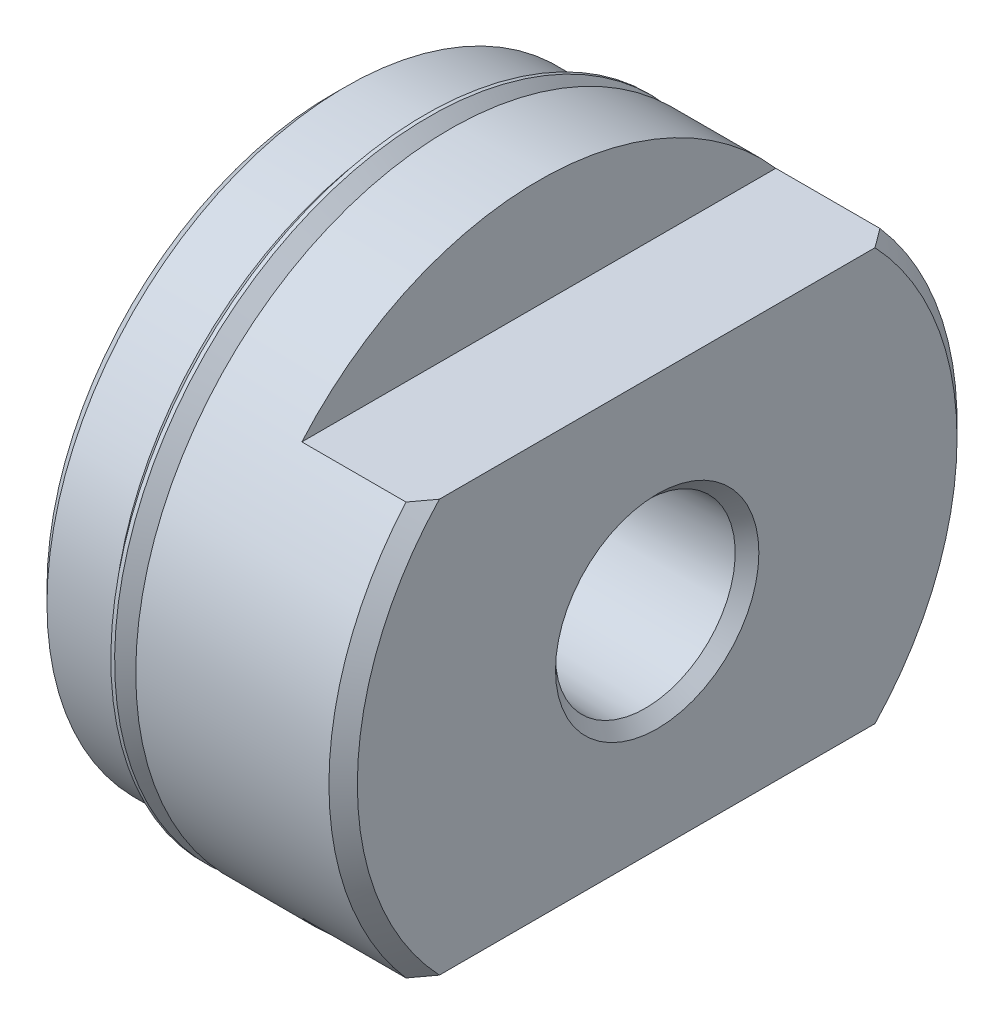
ISO-10303-21;
HEADER;
FILE_DESCRIPTION(('STEP AP214'),'2;1');
FILE_NAME('part.step','',(''),(''),'','','');
FILE_SCHEMA(('AUTOMOTIVE_DESIGN { 1 0 10303 214 1 1 1 1 }'));
ENDSEC;
DATA;
#1=APPLICATION_CONTEXT('core data for automotive mechanical design processes');
#2=APPLICATION_PROTOCOL_DEFINITION('international standard','automotive_design',2000,#1);
#3=PRODUCT_CONTEXT('',#1,'mechanical');
#4=PRODUCT('Part','Part','',(#3));
#5=PRODUCT_RELATED_PRODUCT_CATEGORY('part','',(#4));
#6=PRODUCT_DEFINITION_FORMATION('','',#4);
#7=PRODUCT_DEFINITION_CONTEXT('part definition',#1,'design');
#8=PRODUCT_DEFINITION('design','',#6,#7);
#9=PRODUCT_DEFINITION_SHAPE('','',#8);
#10=(LENGTH_UNIT() NAMED_UNIT(*) SI_UNIT(.MILLI.,.METRE.));
#11=(NAMED_UNIT(*) PLANE_ANGLE_UNIT() SI_UNIT($,.RADIAN.));
#12=(NAMED_UNIT(*) SI_UNIT($,.STERADIAN.) SOLID_ANGLE_UNIT());
#13=UNCERTAINTY_MEASURE_WITH_UNIT(LENGTH_MEASURE(1.E-05),#10,'distance_accuracy_value','');
#14=(GEOMETRIC_REPRESENTATION_CONTEXT(3) GLOBAL_UNCERTAINTY_ASSIGNED_CONTEXT((#13)) GLOBAL_UNIT_ASSIGNED_CONTEXT((#10,
#11,#12)) REPRESENTATION_CONTEXT('',''));
#15=CARTESIAN_POINT('',(0.,0.,0.));
#16=DIRECTION('',(0.,0.,1.));
#17=DIRECTION('',(1.,0.,0.));
#18=AXIS2_PLACEMENT_3D('',#15,#16,#17);
#19=CARTESIAN_POINT('',(17.4752,0.,0.));
#20=DIRECTION('',(-1.,0.,0.));
#21=DIRECTION('',(0.,0.,1.));
#22=AXIS2_PLACEMENT_3D('',#19,#20,#21);
#23=CYLINDRICAL_SURFACE('',#22,15.00505);
#24=CARTESIAN_POINT('',(5.334,0.,0.));
#25=DIRECTION('',(-1.,0.,0.));
#26=DIRECTION('',(0.,0.,1.));
#27=AXIS2_PLACEMENT_3D('',#24,#25,#26);
#28=CIRCLE('',#27,15.00505);
#29=CARTESIAN_POINT('',(5.334,0.,15.00505));
#30=VERTEX_POINT('',#29);
#31=EDGE_CURVE('E122',#30,#30,#28,.T.);
#32=ORIENTED_EDGE('',*,*,#31,.F.);
#33=EDGE_LOOP('',(#32));
#34=FACE_BOUND('',#33,.T.);
#35=CARTESIAN_POINT('',(5.84200000000003,0.,0.));
#36=DIRECTION('',(1.,0.,0.));
#37=DIRECTION('',(0.,1.,0.));
#38=AXIS2_PLACEMENT_3D('',#35,#36,#37);
#39=CIRCLE('',#38,15.00505);
#40=CARTESIAN_POINT('',(5.84199999999987,15.0050500000001,0.));
#41=VERTEX_POINT('',#40);
#42=EDGE_CURVE('E11',#41,#41,#39,.T.);
#43=ORIENTED_EDGE('',*,*,#42,.F.);
#44=EDGE_LOOP('',(#43));
#45=FACE_BOUND('',#44,.T.);
#46=ADVANCED_FACE('F37',(#34,#45),#23,.T.);
#47=CARTESIAN_POINT('',(6.35,15.00505,0.));
#48=DIRECTION('',(1.,0.,0.));
#49=DIRECTION('',(0.,0.,-1.));
#50=AXIS2_PLACEMENT_3D('',#47,#48,#49);
#51=PLANE('',#50);
#52=CARTESIAN_POINT('',(6.35,0.,0.));
#53=DIRECTION('',(-1.,0.,0.));
#54=DIRECTION('',(0.,0.,1.));
#55=AXIS2_PLACEMENT_3D('',#52,#53,#54);
#56=CIRCLE('',#55,16.84655);
#57=CARTESIAN_POINT('',(6.35,0.,16.84655));
#58=VERTEX_POINT('',#57);
#59=EDGE_CURVE('E119',#58,#58,#56,.T.);
#60=ORIENTED_EDGE('',*,*,#59,.T.);
#61=EDGE_LOOP('',(#60));
#62=FACE_BOUND('',#61,.T.);
#63=CARTESIAN_POINT('',(6.35,0.,-1.74452221282598E-13));
#64=DIRECTION('',(1.,0.,0.));
#65=DIRECTION('',(0.,0.,-1.));
#66=AXIS2_PLACEMENT_3D('',#63,#64,#65);
#67=CIRCLE('',#66,15.7132591752454);
#68=CARTESIAN_POINT('',(6.35,0.,-15.7132591752456));
#69=VERTEX_POINT('',#68);
#70=EDGE_CURVE('E45',#69,#69,#67,.F.);
#71=ORIENTED_EDGE('',*,*,#70,.F.);
#72=EDGE_LOOP('',(#71));
#73=FACE_BOUND('',#72,.T.);
#74=ADVANCED_FACE('F179',(#62,#73),#51,.F.);
#75=CARTESIAN_POINT('',(0.,0.,0.));
#76=DIRECTION('',(1.,0.,0.));
#77=DIRECTION('',(0.,0.,-1.));
#78=AXIS2_PLACEMENT_3D('',#75,#76,#77);
#79=PLANE('',#78);
#80=CARTESIAN_POINT('',(0.,0.,0.));
#81=DIRECTION('',(-1.,0.,0.));
#82=DIRECTION('',(0.,0.,1.));
#83=AXIS2_PLACEMENT_3D('',#80,#81,#82);
#84=CIRCLE('',#83,15.25905);
#85=CARTESIAN_POINT('',(0.,0.,15.25905));
#86=VERTEX_POINT('',#85);
#87=EDGE_CURVE('E131',#86,#86,#84,.T.);
#88=ORIENTED_EDGE('',*,*,#87,.T.);
#89=EDGE_LOOP('',(#88));
#90=FACE_BOUND('',#89,.T.);
#91=CARTESIAN_POINT('',(0.,0.,0.));
#92=DIRECTION('',(-1.,0.,0.));
#93=DIRECTION('',(0.,0.,1.));
#94=AXIS2_PLACEMENT_3D('',#91,#92,#93);
#95=CIRCLE('',#94,11.1125);
#96=CARTESIAN_POINT('',(0.,0.,11.1125));
#97=VERTEX_POINT('',#96);
#98=EDGE_CURVE('E213',#97,#97,#95,.T.);
#99=ORIENTED_EDGE('',*,*,#98,.F.);
#100=EDGE_LOOP('',(#99));
#101=FACE_BOUND('',#100,.T.);
#102=ADVANCED_FACE('F39',(#90,#101),#79,.F.);
#103=CARTESIAN_POINT('',(16.840187191015,0.,0.));
#104=DIRECTION('',(1.,0.,0.));
#105=DIRECTION('',(0.,0.,-1.));
#106=AXIS2_PLACEMENT_3D('',#103,#104,#105);
#107=CONICAL_SURFACE('',#106,4.8196511161649,0.0312094049979799);
#108=CARTESIAN_POINT('',(16.840187191015,0.,0.));
#109=DIRECTION('',(-1.,0.,0.));
#110=DIRECTION('',(0.,0.,1.));
#111=AXIS2_PLACEMENT_3D('',#108,#109,#110);
#112=CIRCLE('',#111,4.8196511161649);
#113=CARTESIAN_POINT('',(16.840187191015,0.,4.8196511161649));
#114=VERTEX_POINT('',#113);
#115=EDGE_CURVE('E115',#114,#114,#112,.T.);
#116=ORIENTED_EDGE('',*,*,#115,.F.);
#117=EDGE_LOOP('',(#116));
#118=FACE_BOUND('',#117,.T.);
#119=CARTESIAN_POINT('',(7.9248,0.,0.));
#120=DIRECTION('',(-1.,0.,0.));
#121=DIRECTION('',(0.,0.,1.));
#122=AXIS2_PLACEMENT_3D('',#119,#120,#121);
#123=CIRCLE('',#122,4.54131681236612);
#124=CARTESIAN_POINT('',(7.9248,0.,4.54131681236612));
#125=VERTEX_POINT('',#124);
#126=EDGE_CURVE('E215',#125,#125,#123,.T.);
#127=ORIENTED_EDGE('',*,*,#126,.T.);
#128=EDGE_LOOP('',(#127));
#129=FACE_BOUND('',#128,.T.);
#130=ADVANCED_FACE('F167',(#118,#129),#107,.F.);
#131=CARTESIAN_POINT('',(17.4752,16.08455,0.));
#132=DIRECTION('',(-1.,0.,0.));
#133=DIRECTION('',(0.,0.,1.));
#134=AXIS2_PLACEMENT_3D('',#131,#132,#133);
#135=PLANE('',#134);
#136=CARTESIAN_POINT('',(17.4752000000002,0.,0.));
#137=DIRECTION('',(-1.,0.,0.));
#138=DIRECTION('',(0.,0.,1.));
#139=AXIS2_PLACEMENT_3D('',#136,#137,#138);
#140=CIRCLE('',#139,5.45466392515005);
#141=CARTESIAN_POINT('',(17.4752000000002,0.,5.45466392515005));
#142=VERTEX_POINT('',#141);
#143=EDGE_CURVE('E236',#142,#142,#140,.T.);
#144=ORIENTED_EDGE('',*,*,#143,.T.);
#145=EDGE_LOOP('',(#144));
#146=FACE_BOUND('',#145,.T.);
#147=DIRECTION('',(0.,0.,1.));
#148=VECTOR('',#147,1.);
#149=CARTESIAN_POINT('',(17.4752,11.05535,-33.6931));
#150=LINE('',#149,#148);
#151=CARTESIAN_POINT('',(17.4752,11.05535,-11.6829784336016));
#152=VERTEX_POINT('',#151);
#153=CARTESIAN_POINT('',(17.4752,11.05535,11.6829784336016));
#154=VERTEX_POINT('',#153);
#155=EDGE_CURVE('E60',#152,#154,#150,.T.);
#156=ORIENTED_EDGE('',*,*,#155,.T.);
#157=CARTESIAN_POINT('',(17.4752,0.,0.));
#158=DIRECTION('',(-1.,0.,0.));
#159=DIRECTION('',(0.,0.,1.));
#160=AXIS2_PLACEMENT_3D('',#157,#158,#159);
#161=CIRCLE('',#160,16.08455);
#162=CARTESIAN_POINT('',(17.4752,-11.05535,11.6829784336016));
#163=VERTEX_POINT('',#162);
#164=EDGE_CURVE('E106',#163,#154,#161,.T.);
#165=ORIENTED_EDGE('',*,*,#164,.F.);
#166=DIRECTION('',(0.,0.,-1.));
#167=VECTOR('',#166,1.);
#168=CARTESIAN_POINT('',(17.4752,-11.05535,33.6931));
#169=LINE('',#168,#167);
#170=CARTESIAN_POINT('',(17.4752,-11.05535,-11.6829784336016));
#171=VERTEX_POINT('',#170);
#172=EDGE_CURVE('E52',#163,#171,#169,.T.);
#173=ORIENTED_EDGE('',*,*,#172,.T.);
#174=EDGE_CURVE('E104',#152,#171,#161,.T.);
#175=ORIENTED_EDGE('',*,*,#174,.F.);
#176=EDGE_LOOP('',(#156,#165,#173,#175));
#177=FACE_BOUND('',#176,.T.);
#178=ADVANCED_FACE('F103',(#146,#177),#135,.F.);
#179=CARTESIAN_POINT('',(17.4752,0.,0.));
#180=DIRECTION('',(-1.,0.,0.));
#181=DIRECTION('',(0.,0.,1.));
#182=AXIS2_PLACEMENT_3D('',#179,#180,#181);
#183=CYLINDRICAL_SURFACE('',#182,16.84655);
#184=ORIENTED_EDGE('',*,*,#59,.F.);
#185=EDGE_LOOP('',(#184));
#186=FACE_BOUND('',#185,.T.);
#187=DIRECTION('',(-1.,0.,0.));
#188=VECTOR('',#187,1.);
#189=CARTESIAN_POINT('',(17.4752,11.05535,-12.7116278768693));
#190=LINE('',#189,#188);
#191=CARTESIAN_POINT('',(16.7132,11.05535,-12.7116278768693));
#192=VERTEX_POINT('',#191);
#193=CARTESIAN_POINT('',(11.1252,11.05535,-12.7116278768693));
#194=VERTEX_POINT('',#193);
#195=EDGE_CURVE('E233',#192,#194,#190,.T.);
#196=ORIENTED_EDGE('',*,*,#195,.F.);
#197=CARTESIAN_POINT('',(16.7132,0.,0.));
#198=DIRECTION('',(-1.,0.,0.));
#199=DIRECTION('',(0.,0.,1.));
#200=AXIS2_PLACEMENT_3D('',#197,#198,#199);
#201=CIRCLE('',#200,16.84655);
#202=CARTESIAN_POINT('',(16.7132,-11.05535,-12.7116278768693));
#203=VERTEX_POINT('',#202);
#204=EDGE_CURVE('E113',#192,#203,#201,.T.);
#205=ORIENTED_EDGE('',*,*,#204,.T.);
#206=DIRECTION('',(-1.,0.,0.));
#207=VECTOR('',#206,1.);
#208=CARTESIAN_POINT('',(17.4752,-11.05535,-12.7116278768693));
#209=LINE('',#208,#207);
#210=CARTESIAN_POINT('',(11.1252,-11.05535,-12.7116278768693));
#211=VERTEX_POINT('',#210);
#212=EDGE_CURVE('E92',#211,#203,#209,.F.);
#213=ORIENTED_EDGE('',*,*,#212,.F.);
#214=CARTESIAN_POINT('',(11.1252,0.,0.));
#215=DIRECTION('',(1.,0.,0.));
#216=DIRECTION('',(0.,0.,-1.));
#217=AXIS2_PLACEMENT_3D('',#214,#215,#216);
#218=CIRCLE('',#217,16.84655);
#219=CARTESIAN_POINT('',(11.1252,-11.05535,12.7116278768693));
#220=VERTEX_POINT('',#219);
#221=EDGE_CURVE('E466',#220,#211,#218,.T.);
#222=ORIENTED_EDGE('',*,*,#221,.F.);
#223=DIRECTION('',(-1.,0.,0.));
#224=VECTOR('',#223,1.);
#225=CARTESIAN_POINT('',(17.4752,-11.05535,12.7116278768693));
#226=LINE('',#225,#224);
#227=CARTESIAN_POINT('',(16.7132,-11.05535,12.7116278768693));
#228=VERTEX_POINT('',#227);
#229=EDGE_CURVE('E229',#228,#220,#226,.T.);
#230=ORIENTED_EDGE('',*,*,#229,.F.);
#231=CARTESIAN_POINT('',(16.7132,11.05535,12.7116278768693));
#232=VERTEX_POINT('',#231);
#233=EDGE_CURVE('E110',#228,#232,#201,.T.);
#234=ORIENTED_EDGE('',*,*,#233,.T.);
#235=DIRECTION('',(-1.,0.,0.));
#236=VECTOR('',#235,1.);
#237=CARTESIAN_POINT('',(17.4752,11.05535,12.7116278768693));
#238=LINE('',#237,#236);
#239=CARTESIAN_POINT('',(11.1252,11.05535,12.7116278768693));
#240=VERTEX_POINT('',#239);
#241=EDGE_CURVE('E235',#240,#232,#238,.F.);
#242=ORIENTED_EDGE('',*,*,#241,.F.);
#243=EDGE_CURVE('E474',#194,#240,#218,.T.);
#244=ORIENTED_EDGE('',*,*,#243,.F.);
#245=EDGE_LOOP('',(#196,#205,#213,#222,#230,#234,#242,#244));
#246=FACE_BOUND('',#245,.T.);
#247=ADVANCED_FACE('F171',(#186,#246),#183,.T.);
#248=CARTESIAN_POINT('',(17.4752,0.,0.));
#249=DIRECTION('',(-1.,0.,0.));
#250=DIRECTION('',(0.,0.,1.));
#251=AXIS2_PLACEMENT_3D('',#248,#249,#250);
#252=CONICAL_SURFACE('',#251,16.08455,0.785398163397451);
#253=CARTESIAN_POINT('',(-3.50802933531327,11.05535,35.3807786973236));
#254=CARTESIAN_POINT('',(-2.90157093176611,11.05535,34.745381236506));
#255=CARTESIAN_POINT('',(-2.29585064096126,11.05535,34.1092775418181));
#256=CARTESIAN_POINT('',(-1.08619729050607,11.05535,32.8353653077241));
#257=CARTESIAN_POINT('',(-0.482264242747268,11.05535,32.1975567570282));
#258=CARTESIAN_POINT('',(0.723667510123653,11.05535,30.9197686619306));
#259=CARTESIAN_POINT('',(1.32566561438743,11.05535,30.2797885502002));
#260=CARTESIAN_POINT('',(2.52713380270052,11.05535,28.9974612861288));
#261=CARTESIAN_POINT('',(3.12660389232696,11.05535,28.3551141390157));
#262=CARTESIAN_POINT('',(4.32757473526507,11.05535,27.0620991121119));
#263=CARTESIAN_POINT('',(4.92904935311628,11.05535,26.4114069426017));
#264=CARTESIAN_POINT('',(6.12817516404846,11.05535,25.1065091432041));
#265=CARTESIAN_POINT('',(6.72582636717304,11.05535,24.4523035225545));
#266=CARTESIAN_POINT('',(7.91626428251673,11.05535,23.1396646824184));
#267=CARTESIAN_POINT('',(8.50905174336296,11.05535,22.4812321424431));
#268=CARTESIAN_POINT('',(9.68857183919225,11.05535,21.1589665018712));
#269=CARTESIAN_POINT('',(10.275304536162,11.05535,20.4951334566879));
#270=CARTESIAN_POINT('',(11.220086151054,11.05535,19.4134076240238));
#271=CARTESIAN_POINT('',(11.5805528040167,11.05535,18.9976268146301));
#272=CARTESIAN_POINT('',(12.2978602867262,11.05535,18.1629509877087));
#273=CARTESIAN_POINT('',(12.6547011432941,11.05535,17.7440559932572));
#274=CARTESIAN_POINT('',(13.3641394432373,11.05535,16.9024611463813));
#275=CARTESIAN_POINT('',(13.7167355356511,11.05535,16.4797601537451));
#276=CARTESIAN_POINT('',(14.4166244934949,11.05535,15.6299900062558));
#277=CARTESIAN_POINT('',(14.7639174101144,11.05535,15.2029208936329));
#278=CARTESIAN_POINT('',(15.4512720845798,11.05535,14.3444153571712));
#279=CARTESIAN_POINT('',(15.7913471036119,11.05535,13.9129895726105));
#280=CARTESIAN_POINT('',(16.4633829227008,11.05535,13.0438116255068));
#281=CARTESIAN_POINT('',(16.7953433208045,11.05535,12.6060591512771));
#282=CARTESIAN_POINT('',(17.4487678009372,11.05535,11.7231031726143));
#283=CARTESIAN_POINT('',(17.7702370616757,11.05535,11.2779035136458));
#284=CARTESIAN_POINT('',(18.3998035615026,11.05535,10.3781806482597));
#285=CARTESIAN_POINT('',(18.7079026075926,11.05535,9.9236587140643));
#286=CARTESIAN_POINT('',(19.2535694567247,11.05535,9.08453452279499));
#287=CARTESIAN_POINT('',(19.4939737659316,11.05535,8.70178460110867));
#288=CARTESIAN_POINT('',(19.9596293480872,11.05535,7.92706972070036));
#289=CARTESIAN_POINT('',(20.1848789538213,11.05535,7.53510375447379));
#290=CARTESIAN_POINT('',(20.61599452939,11.05535,6.74029632030322));
#291=CARTESIAN_POINT('',(20.8218521731078,11.05535,6.33745027555277));
#292=CARTESIAN_POINT('',(21.1116300835477,11.05535,5.72426992887177));
#293=CARTESIAN_POINT('',(21.2050461408209,11.05535,5.51841253707331));
#294=CARTESIAN_POINT('',(21.3847059991348,11.05535,5.10352116645012));
#295=CARTESIAN_POINT('',(21.4709478623132,11.05535,4.8944863472701));
#296=CARTESIAN_POINT('',(21.6826009105379,11.05535,4.35193059853052));
#297=CARTESIAN_POINT('',(21.8019821684594,11.05535,4.0160168083531));
#298=CARTESIAN_POINT('',(22.0163712365773,11.05535,3.33655949063778));
#299=CARTESIAN_POINT('',(22.1113884194634,11.05535,2.99301895248623));
#300=CARTESIAN_POINT('',(22.2725669665782,11.05535,2.30055612162405));
#301=CARTESIAN_POINT('',(22.338840409905,11.05535,1.95166032635875));
#302=CARTESIAN_POINT('',(22.4394661866448,11.05535,1.24925645307366));
#303=CARTESIAN_POINT('',(22.4738219892713,11.05535,0.89574888055672));
#304=CARTESIAN_POINT('',(22.5086167853688,11.05535,0.184265886872936));
#305=CARTESIAN_POINT('',(22.5087888946976,11.05535,-0.173722868716797));
#306=CARTESIAN_POINT('',(22.4745338279258,11.05535,-0.888016256433265));
#307=CARTESIAN_POINT('',(22.4401056563494,11.05535,-1.24432083980878));
#308=CARTESIAN_POINT('',(22.3386690575157,11.05535,-1.95332731166701));
#309=CARTESIAN_POINT('',(22.2715588671025,11.05535,-2.30601441063605));
#310=CARTESIAN_POINT('',(22.1084275301252,11.05535,-3.00458108007854));
#311=CARTESIAN_POINT('',(22.0124001391952,11.05535,-3.35045916301285));
#312=CARTESIAN_POINT('',(21.734396922196,11.05535,-4.22807045450594));
#313=CARTESIAN_POINT('',(21.5345419254497,11.05535,-4.75415114925485));
#314=CARTESIAN_POINT('',(21.2013092237558,11.05535,-5.52852809559209));
#315=CARTESIAN_POINT('',(21.0845886466944,11.05535,-5.78432289817214));
#316=CARTESIAN_POINT('',(20.8415712487147,11.05535,-6.29132744195133));
#317=CARTESIAN_POINT('',(20.7152752587592,11.05535,-6.54253757866984));
#318=CARTESIAN_POINT('',(20.453102324093,11.05535,-7.04340021685863));
#319=CARTESIAN_POINT('',(20.317135330501,11.05535,-7.29300525016907));
#320=CARTESIAN_POINT('',(20.0380967626274,11.05535,-7.78820763561871));
#321=CARTESIAN_POINT('',(19.8950250870211,11.05535,-8.03380493053452));
#322=CARTESIAN_POINT('',(19.6028789023574,11.05535,-8.52123997100479));
#323=CARTESIAN_POINT('',(19.4538071654646,11.05535,-8.7630793827981));
#324=CARTESIAN_POINT('',(19.1504656570717,11.05535,-9.24345072542215));
#325=CARTESIAN_POINT('',(18.9961961512198,11.05535,-9.48198282440658));
#326=CARTESIAN_POINT('',(18.6320495160097,11.05535,-10.0335092819068));
#327=CARTESIAN_POINT('',(18.4204675991922,11.05535,-10.3453773769429));
#328=CARTESIAN_POINT('',(17.9907658996731,11.05535,-10.9645868889342));
#329=CARTESIAN_POINT('',(17.7726457518116,11.05535,-11.2719280516253));
#330=CARTESIAN_POINT('',(17.3309035514969,11.05535,-11.8827268697826));
#331=CARTESIAN_POINT('',(17.1072803006506,11.05535,-12.1861836570935));
#332=CARTESIAN_POINT('',(16.6554289279145,11.05535,-12.7896533874648));
#333=CARTESIAN_POINT('',(16.4272006941533,11.05535,-13.0896662465815));
#334=CARTESIAN_POINT('',(15.7362775849232,11.05535,-13.9857314360567));
#335=CARTESIAN_POINT('',(15.2677345525107,11.05535,-14.5772760189962));
#336=CARTESIAN_POINT('',(14.3192711034044,11.05535,-15.7510123812116));
#337=CARTESIAN_POINT('',(13.8393519428568,11.05535,-16.3332051813065));
#338=CARTESIAN_POINT('',(12.8690526859079,11.05535,-17.492429707695));
#339=CARTESIAN_POINT('',(12.3786406805855,11.05535,-18.0694346768107));
#340=CARTESIAN_POINT('',(11.3910320994363,11.05535,-19.2176202553057));
#341=CARTESIAN_POINT('',(10.8938353625825,11.05535,-19.7888007258836));
#342=CARTESIAN_POINT('',(9.89434877254828,11.05535,-20.9261569103802));
#343=CARTESIAN_POINT('',(9.39206169608507,11.05535,-21.4923350674926));
#344=CARTESIAN_POINT('',(8.38318941018838,11.05535,-22.6208358046961));
#345=CARTESIAN_POINT('',(7.87660423667574,11.05535,-23.1831584169384));
#346=CARTESIAN_POINT('',(6.47369936850387,11.05535,-24.7307017830358));
#347=CARTESIAN_POINT('',(5.57371871967452,11.05535,-25.7126028892259));
#348=CARTESIAN_POINT('',(3.76586834170466,11.05535,-27.6693723895952));
#349=CARTESIAN_POINT('',(2.85799744361525,11.05535,-28.6442397011608));
#350=CARTESIAN_POINT('',(1.04279326159835,11.05535,-30.5817863055032));
#351=CARTESIAN_POINT('',(0.135500103044221,11.05535,-31.5445032154263));
#352=CARTESIAN_POINT('',(-1.22864341312509,11.05535,-32.9853803446911));
#353=CARTESIAN_POINT('',(-1.6838515610504,11.05535,-33.4650974804624));
#354=CARTESIAN_POINT('',(-2.59524071673936,11.05535,-34.4236050020605));
#355=CARTESIAN_POINT('',(-3.05142172259213,11.05535,-34.9023953897042));
#356=CARTESIAN_POINT('',(-3.50802933531327,11.05535,-35.3807786973236));
#357=B_SPLINE_CURVE_WITH_KNOTS('',3,(#253,#254,#255,#256,#257,#258,#259,#260,#261,#262,#263,
#264,#265,#266,#267,#268,#269,#270,#271,#272,#273,#274,#275,#276,#277,#278,#279,#280,#281,#282,
#283,#284,#285,#286,#287,#288,#289,#290,#291,#292,#293,#294,#295,#296,#297,#298,#299,#300,#301,
#302,#303,#304,#305,#306,#307,#308,#309,#310,#311,#312,#313,#314,#315,#316,#317,#318,#319,#320,
#321,#322,#323,#324,#325,#326,#327,#328,#329,#330,#331,#332,#333,#334,#335,#336,#337,#338,#339,
#340,#341,#342,#343,#344,#345,#346,#347,#348,#349,#350,#351,#352,#353,#354,#355,#356),
.UNSPECIFIED.,.F.,.F.,(4,2,2,2,2,2,2,2,2,2,2,2,2,2,2,2,2,2,2,2,2,2,2,2,2,2,2,2,2,2,2,2,2,2,2,2,
2,2,2,2,2,2,2,2,2,2,2,2,2,2,2,4),(0.,2.63509056933052,5.27019863217188,7.90605828621354,
10.5419121221595,13.2001979530027,15.8584767980087,18.5163385015179,21.1741729676871,
22.8250013924296,24.4758175966687,26.1271460017337,27.7784584570825,29.4264150334377,
31.0744530756768,32.7216649031703,34.3686534100819,35.7243350644443,37.0801656183778,
38.4365756822995,39.1146435719272,39.7928940275692,40.8615740445502,41.9298423289101,
42.9939068742321,44.0578557500058,45.1301109256894,46.2023969518353,47.2780433496609,
48.3539221888051,50.0389701407685,50.8823535513546,51.7256638559537,52.5782431608213,
53.4308346283732,54.2830366020969,55.1351950872493,56.2656894882044,57.3962471452928,
58.5270532179157,59.6578867949881,61.9215383382714,64.1849410840415,66.4566444088713,
68.7284017438226,70.9989802536316,73.269539805998,77.2653285741692,81.2617197718136,
85.2303329554852,87.2142893483766,89.1982418479882),.UNSPECIFIED.);
#358=EDGE_CURVE('E465',#232,#154,#357,.T.);
#359=ORIENTED_EDGE('',*,*,#358,.F.);
#360=ORIENTED_EDGE('',*,*,#233,.F.);
#361=CARTESIAN_POINT('',(-3.50802933531327,-11.05535,-35.3807786973236));
#362=CARTESIAN_POINT('',(-2.90157093176611,-11.05535,-34.745381236506));
#363=CARTESIAN_POINT('',(-2.29585064096126,-11.05535,-34.1092775418181));
#364=CARTESIAN_POINT('',(-1.08619729050607,-11.05535,-32.8353653077241));
#365=CARTESIAN_POINT('',(-0.482264242747268,-11.05535,-32.1975567570282));
#366=CARTESIAN_POINT('',(0.723667510123653,-11.05535,-30.9197686619306));
#367=CARTESIAN_POINT('',(1.32566561438743,-11.05535,-30.2797885502002));
#368=CARTESIAN_POINT('',(2.52713380270052,-11.05535,-28.9974612861288));
#369=CARTESIAN_POINT('',(3.12660389232696,-11.05535,-28.3551141390157));
#370=CARTESIAN_POINT('',(4.32757473526507,-11.05535,-27.0620991121119));
#371=CARTESIAN_POINT('',(4.92904935311628,-11.05535,-26.4114069426017));
#372=CARTESIAN_POINT('',(6.12817516404846,-11.05535,-25.1065091432041));
#373=CARTESIAN_POINT('',(6.72582636717304,-11.05535,-24.4523035225545));
#374=CARTESIAN_POINT('',(7.91626428251673,-11.05535,-23.1396646824184));
#375=CARTESIAN_POINT('',(8.50905174336296,-11.05535,-22.4812321424431));
#376=CARTESIAN_POINT('',(9.68857183919225,-11.05535,-21.1589665018712));
#377=CARTESIAN_POINT('',(10.275304536162,-11.05535,-20.4951334566879));
#378=CARTESIAN_POINT('',(11.220086151054,-11.05535,-19.4134076240238));
#379=CARTESIAN_POINT('',(11.5805528040167,-11.05535,-18.9976268146301));
#380=CARTESIAN_POINT('',(12.2978602867262,-11.05535,-18.1629509877087));
#381=CARTESIAN_POINT('',(12.6547011432941,-11.05535,-17.7440559932572));
#382=CARTESIAN_POINT('',(13.3641394432373,-11.05535,-16.9024611463813));
#383=CARTESIAN_POINT('',(13.7167355356511,-11.05535,-16.4797601537451));
#384=CARTESIAN_POINT('',(14.4166244934949,-11.05535,-15.6299900062558));
#385=CARTESIAN_POINT('',(14.7639174101144,-11.05535,-15.2029208936329));
#386=CARTESIAN_POINT('',(15.4512720845798,-11.05535,-14.3444153571712));
#387=CARTESIAN_POINT('',(15.7913471036119,-11.05535,-13.9129895726105));
#388=CARTESIAN_POINT('',(16.4633829227008,-11.05535,-13.0438116255068));
#389=CARTESIAN_POINT('',(16.7953433208045,-11.05535,-12.6060591512771));
#390=CARTESIAN_POINT('',(17.4487678009372,-11.05535,-11.7231031726143));
#391=CARTESIAN_POINT('',(17.7702370616757,-11.05535,-11.2779035136458));
#392=CARTESIAN_POINT('',(18.3998035615026,-11.05535,-10.3781806482597));
#393=CARTESIAN_POINT('',(18.7079026075926,-11.05535,-9.9236587140643));
#394=CARTESIAN_POINT('',(19.2535694567247,-11.05535,-9.08453452279499));
#395=CARTESIAN_POINT('',(19.4939737659316,-11.05535,-8.70178460110867));
#396=CARTESIAN_POINT('',(19.9596293480872,-11.05535,-7.92706972070036));
#397=CARTESIAN_POINT('',(20.1848789538213,-11.05535,-7.53510375447379));
#398=CARTESIAN_POINT('',(20.61599452939,-11.05535,-6.74029632030322));
#399=CARTESIAN_POINT('',(20.8218521731078,-11.05535,-6.33745027555277));
#400=CARTESIAN_POINT('',(21.1116300835477,-11.05535,-5.72426992887177));
#401=CARTESIAN_POINT('',(21.2050461408209,-11.05535,-5.51841253707331));
#402=CARTESIAN_POINT('',(21.3847059991348,-11.05535,-5.10352116645012));
#403=CARTESIAN_POINT('',(21.4709478623132,-11.05535,-4.8944863472701));
#404=CARTESIAN_POINT('',(21.6826009105379,-11.05535,-4.35193059853052));
#405=CARTESIAN_POINT('',(21.8019821684594,-11.05535,-4.0160168083531));
#406=CARTESIAN_POINT('',(22.0163712365773,-11.05535,-3.33655949063778));
#407=CARTESIAN_POINT('',(22.1113884194634,-11.05535,-2.99301895248623));
#408=CARTESIAN_POINT('',(22.2725669665782,-11.05535,-2.30055612162405));
#409=CARTESIAN_POINT('',(22.338840409905,-11.05535,-1.95166032635875));
#410=CARTESIAN_POINT('',(22.4394661866448,-11.05535,-1.24925645307366));
#411=CARTESIAN_POINT('',(22.4738219892713,-11.05535,-0.89574888055672));
#412=CARTESIAN_POINT('',(22.5086167853688,-11.05535,-0.184265886872936));
#413=CARTESIAN_POINT('',(22.5087888946976,-11.05535,0.173722868716797));
#414=CARTESIAN_POINT('',(22.4745338279258,-11.05535,0.888016256433265));
#415=CARTESIAN_POINT('',(22.4401056563494,-11.05535,1.24432083980878));
#416=CARTESIAN_POINT('',(22.3386690575157,-11.05535,1.95332731166701));
#417=CARTESIAN_POINT('',(22.2715588671025,-11.05535,2.30601441063605));
#418=CARTESIAN_POINT('',(22.1084275301252,-11.05535,3.00458108007854));
#419=CARTESIAN_POINT('',(22.0124001391952,-11.05535,3.35045916301285));
#420=CARTESIAN_POINT('',(21.734396922196,-11.05535,4.22807045450594));
#421=CARTESIAN_POINT('',(21.5345419254497,-11.05535,4.75415114925485));
#422=CARTESIAN_POINT('',(21.2013092237558,-11.05535,5.52852809559209));
#423=CARTESIAN_POINT('',(21.0845886466944,-11.05535,5.78432289817214));
#424=CARTESIAN_POINT('',(20.8415712487147,-11.05535,6.29132744195133));
#425=CARTESIAN_POINT('',(20.7152752587592,-11.05535,6.54253757866984));
#426=CARTESIAN_POINT('',(20.453102324093,-11.05535,7.04340021685863));
#427=CARTESIAN_POINT('',(20.317135330501,-11.05535,7.29300525016907));
#428=CARTESIAN_POINT('',(20.0380967626274,-11.05535,7.78820763561871));
#429=CARTESIAN_POINT('',(19.8950250870211,-11.05535,8.03380493053452));
#430=CARTESIAN_POINT('',(19.6028789023574,-11.05535,8.52123997100479));
#431=CARTESIAN_POINT('',(19.4538071654646,-11.05535,8.7630793827981));
#432=CARTESIAN_POINT('',(19.1504656570717,-11.05535,9.24345072542215));
#433=CARTESIAN_POINT('',(18.9961961512198,-11.05535,9.48198282440658));
#434=CARTESIAN_POINT('',(18.6320495160097,-11.05535,10.0335092819068));
#435=CARTESIAN_POINT('',(18.4204675991922,-11.05535,10.3453773769429));
#436=CARTESIAN_POINT('',(17.9907658996731,-11.05535,10.9645868889342));
#437=CARTESIAN_POINT('',(17.7726457518116,-11.05535,11.2719280516253));
#438=CARTESIAN_POINT('',(17.3309035514969,-11.05535,11.8827268697826));
#439=CARTESIAN_POINT('',(17.1072803006506,-11.05535,12.1861836570935));
#440=CARTESIAN_POINT('',(16.6554289279145,-11.05535,12.7896533874648));
#441=CARTESIAN_POINT('',(16.4272006941533,-11.05535,13.0896662465815));
#442=CARTESIAN_POINT('',(15.7362775849232,-11.05535,13.9857314360567));
#443=CARTESIAN_POINT('',(15.2677345525107,-11.05535,14.5772760189962));
#444=CARTESIAN_POINT('',(14.3192711034044,-11.05535,15.7510123812116));
#445=CARTESIAN_POINT('',(13.8393519428568,-11.05535,16.3332051813065));
#446=CARTESIAN_POINT('',(12.8690526859079,-11.05535,17.492429707695));
#447=CARTESIAN_POINT('',(12.3786406805855,-11.05535,18.0694346768107));
#448=CARTESIAN_POINT('',(11.3910320994363,-11.05535,19.2176202553057));
#449=CARTESIAN_POINT('',(10.8938353625825,-11.05535,19.7888007258836));
#450=CARTESIAN_POINT('',(9.89434877254828,-11.05535,20.9261569103802));
#451=CARTESIAN_POINT('',(9.39206169608507,-11.05535,21.4923350674926));
#452=CARTESIAN_POINT('',(8.38318941018838,-11.05535,22.6208358046961));
#453=CARTESIAN_POINT('',(7.87660423667574,-11.05535,23.1831584169384));
#454=CARTESIAN_POINT('',(6.47369936850387,-11.05535,24.7307017830358));
#455=CARTESIAN_POINT('',(5.57371871967452,-11.05535,25.7126028892259));
#456=CARTESIAN_POINT('',(3.76586834170466,-11.05535,27.6693723895952));
#457=CARTESIAN_POINT('',(2.85799744361525,-11.05535,28.6442397011608));
#458=CARTESIAN_POINT('',(1.04279326159835,-11.05535,30.5817863055032));
#459=CARTESIAN_POINT('',(0.135500103044221,-11.05535,31.5445032154263));
#460=CARTESIAN_POINT('',(-1.22864341312509,-11.05535,32.9853803446911));
#461=CARTESIAN_POINT('',(-1.6838515610504,-11.05535,33.4650974804624));
#462=CARTESIAN_POINT('',(-2.59524071673936,-11.05535,34.4236050020605));
#463=CARTESIAN_POINT('',(-3.05142172259213,-11.05535,34.9023953897042));
#464=CARTESIAN_POINT('',(-3.50802933531327,-11.05535,35.3807786973236));
#465=B_SPLINE_CURVE_WITH_KNOTS('',3,(#361,#362,#363,#364,#365,#366,#367,#368,#369,#370,#371,
#372,#373,#374,#375,#376,#377,#378,#379,#380,#381,#382,#383,#384,#385,#386,#387,#388,#389,#390,
#391,#392,#393,#394,#395,#396,#397,#398,#399,#400,#401,#402,#403,#404,#405,#406,#407,#408,#409,
#410,#411,#412,#413,#414,#415,#416,#417,#418,#419,#420,#421,#422,#423,#424,#425,#426,#427,#428,
#429,#430,#431,#432,#433,#434,#435,#436,#437,#438,#439,#440,#441,#442,#443,#444,#445,#446,#447,
#448,#449,#450,#451,#452,#453,#454,#455,#456,#457,#458,#459,#460,#461,#462,#463,#464),
.UNSPECIFIED.,.F.,.F.,(4,2,2,2,2,2,2,2,2,2,2,2,2,2,2,2,2,2,2,2,2,2,2,2,2,2,2,2,2,2,2,2,2,2,2,2,
2,2,2,2,2,2,2,2,2,2,2,2,2,2,2,4),(0.,2.63509056933052,5.27019863217188,7.90605828621354,
10.5419121221595,13.2001979530027,15.8584767980087,18.5163385015179,21.1741729676871,
22.8250013924296,24.4758175966687,26.1271460017337,27.7784584570825,29.4264150334377,
31.0744530756768,32.7216649031703,34.3686534100819,35.7243350644443,37.0801656183778,
38.4365756822995,39.1146435719272,39.7928940275692,40.8615740445502,41.9298423289101,
42.9939068742321,44.0578557500058,45.1301109256894,46.2023969518353,47.2780433496609,
48.3539221888051,50.0389701407685,50.8823535513546,51.7256638559537,52.5782431608213,
53.4308346283732,54.2830366020969,55.1351950872493,56.2656894882044,57.3962471452928,
58.5270532179157,59.6578867949881,61.9215383382714,64.1849410840415,66.4566444088713,
68.7284017438226,70.9989802536316,73.269539805998,77.2653285741692,81.2617197718136,
85.2303329554852,87.2142893483766,89.1982418479882),.UNSPECIFIED.);
#466=EDGE_CURVE('E98',#163,#228,#465,.T.);
#467=ORIENTED_EDGE('',*,*,#466,.F.);
#468=ORIENTED_EDGE('',*,*,#164,.T.);
#469=EDGE_LOOP('',(#359,#360,#467,#468));
#470=FACE_BOUND('',#469,.T.);
#471=ADVANCED_FACE('F144',(#470),#252,.T.);
#472=EDGE_CURVE('E97',#152,#192,#357,.T.);
#473=ORIENTED_EDGE('',*,*,#472,.F.);
#474=ORIENTED_EDGE('',*,*,#174,.T.);
#475=EDGE_CURVE('E88',#203,#171,#465,.T.);
#476=ORIENTED_EDGE('',*,*,#475,.F.);
#477=ORIENTED_EDGE('',*,*,#204,.F.);
#478=EDGE_LOOP('',(#473,#474,#476,#477));
#479=FACE_BOUND('',#478,.T.);
#480=ADVANCED_FACE('F109',(#479),#252,.T.);
#481=CARTESIAN_POINT('',(0.761999999999999,0.,0.));
#482=DIRECTION('',(1.,0.,0.));
#483=DIRECTION('',(0.,0.,-1.));
#484=AXIS2_PLACEMENT_3D('',#481,#482,#483);
#485=CONICAL_SURFACE('',#484,16.02105,0.785398163397448);
#486=ORIENTED_EDGE('',*,*,#87,.F.);
#487=EDGE_LOOP('',(#486));
#488=FACE_BOUND('',#487,.T.);
#489=CARTESIAN_POINT('',(0.761999999999999,0.,0.));
#490=DIRECTION('',(-1.,0.,0.));
#491=DIRECTION('',(0.,0.,1.));
#492=AXIS2_PLACEMENT_3D('',#489,#490,#491);
#493=CIRCLE('',#492,16.02105);
#494=CARTESIAN_POINT('',(0.761999999999999,0.,16.02105));
#495=VERTEX_POINT('',#494);
#496=EDGE_CURVE('E128',#495,#495,#493,.T.);
#497=ORIENTED_EDGE('',*,*,#496,.T.);
#498=EDGE_LOOP('',(#497));
#499=FACE_BOUND('',#498,.T.);
#500=ADVANCED_FACE('F195',(#488,#499),#485,.T.);
#501=CARTESIAN_POINT('',(17.4752,0.,0.));
#502=DIRECTION('',(-1.,0.,0.));
#503=DIRECTION('',(0.,0.,1.));
#504=AXIS2_PLACEMENT_3D('',#501,#502,#503);
#505=CYLINDRICAL_SURFACE('',#504,16.02105);
#506=ORIENTED_EDGE('',*,*,#496,.F.);
#507=EDGE_LOOP('',(#506));
#508=FACE_BOUND('',#507,.T.);
#509=CARTESIAN_POINT('',(4.318,0.,0.));
#510=DIRECTION('',(-1.,0.,0.));
#511=DIRECTION('',(0.,0.,1.));
#512=AXIS2_PLACEMENT_3D('',#509,#510,#511);
#513=CIRCLE('',#512,16.02105);
#514=CARTESIAN_POINT('',(4.318,0.,16.02105));
#515=VERTEX_POINT('',#514);
#516=EDGE_CURVE('E125',#515,#515,#513,.T.);
#517=ORIENTED_EDGE('',*,*,#516,.T.);
#518=EDGE_LOOP('',(#517));
#519=FACE_BOUND('',#518,.T.);
#520=ADVANCED_FACE('F192',(#508,#519),#505,.T.);
#521=CARTESIAN_POINT('',(5.334,0.,0.));
#522=DIRECTION('',(-1.,0.,0.));
#523=DIRECTION('',(0.,0.,1.));
#524=AXIS2_PLACEMENT_3D('',#521,#522,#523);
#525=CONICAL_SURFACE('',#524,15.00505,0.785398163397448);
#526=ORIENTED_EDGE('',*,*,#516,.F.);
#527=EDGE_LOOP('',(#526));
#528=FACE_BOUND('',#527,.T.);
#529=ORIENTED_EDGE('',*,*,#31,.T.);
#530=EDGE_LOOP('',(#529));
#531=FACE_BOUND('',#530,.T.);
#532=ADVANCED_FACE('F165',(#528,#531),#525,.T.);
#533=CARTESIAN_POINT('',(17.4752000000002,0.,0.));
#534=DIRECTION('',(1.,0.,0.));
#535=DIRECTION('',(0.,0.,-1.));
#536=AXIS2_PLACEMENT_3D('',#533,#534,#535);
#537=CONICAL_SURFACE('',#536,5.45466392515005,0.78539816339745);
#538=ORIENTED_EDGE('',*,*,#115,.T.);
#539=EDGE_LOOP('',(#538));
#540=FACE_BOUND('',#539,.T.);
#541=ORIENTED_EDGE('',*,*,#143,.F.);
#542=EDGE_LOOP('',(#541));
#543=FACE_BOUND('',#542,.T.);
#544=ADVANCED_FACE('F152',(#540,#543),#537,.F.);
#545=CARTESIAN_POINT('',(11.1252,-11.05535,33.6931));
#546=DIRECTION('',(0.,-1.,0.));
#547=DIRECTION('',(0.,0.,-1.));
#548=AXIS2_PLACEMENT_3D('',#545,#546,#547);
#549=PLANE('',#548);
#550=ORIENTED_EDGE('',*,*,#212,.T.);
#551=ORIENTED_EDGE('',*,*,#475,.T.);
#552=ORIENTED_EDGE('',*,*,#172,.F.);
#553=ORIENTED_EDGE('',*,*,#466,.T.);
#554=ORIENTED_EDGE('',*,*,#229,.T.);
#555=DIRECTION('',(0.,0.,-1.));
#556=VECTOR('',#555,1.);
#557=CARTESIAN_POINT('',(11.1252,-11.05535,33.6931));
#558=LINE('',#557,#556);
#559=EDGE_CURVE('E227',#220,#211,#558,.T.);
#560=ORIENTED_EDGE('',*,*,#559,.T.);
#561=EDGE_LOOP('',(#550,#551,#552,#553,#554,#560));
#562=FACE_BOUND('',#561,.T.);
#563=ADVANCED_FACE('F89',(#562),#549,.T.);
#564=CARTESIAN_POINT('',(11.1252,0.,0.));
#565=DIRECTION('',(1.,0.,0.));
#566=DIRECTION('',(0.,0.,-1.));
#567=AXIS2_PLACEMENT_3D('',#564,#565,#566);
#568=PLANE('',#567);
#569=ORIENTED_EDGE('',*,*,#221,.T.);
#570=ORIENTED_EDGE('',*,*,#559,.F.);
#571=EDGE_LOOP('',(#569,#570));
#572=FACE_BOUND('',#571,.T.);
#573=ADVANCED_FACE('F151',(#572),#568,.T.);
#574=ORIENTED_EDGE('',*,*,#243,.T.);
#575=DIRECTION('',(0.,0.,1.));
#576=VECTOR('',#575,1.);
#577=CARTESIAN_POINT('',(11.1252,11.05535,-33.6931));
#578=LINE('',#577,#576);
#579=EDGE_CURVE('E107',#194,#240,#578,.T.);
#580=ORIENTED_EDGE('',*,*,#579,.F.);
#581=EDGE_LOOP('',(#574,#580));
#582=FACE_BOUND('',#581,.T.);
#583=ADVANCED_FACE('F159',(#582),#568,.T.);
#584=CARTESIAN_POINT('',(11.1252,11.05535,-33.6931));
#585=DIRECTION('',(0.,1.,0.));
#586=DIRECTION('',(0.,0.,1.));
#587=AXIS2_PLACEMENT_3D('',#584,#585,#586);
#588=PLANE('',#587);
#589=ORIENTED_EDGE('',*,*,#241,.T.);
#590=ORIENTED_EDGE('',*,*,#358,.T.);
#591=ORIENTED_EDGE('',*,*,#155,.F.);
#592=ORIENTED_EDGE('',*,*,#472,.T.);
#593=ORIENTED_EDGE('',*,*,#195,.T.);
#594=ORIENTED_EDGE('',*,*,#579,.T.);
#595=EDGE_LOOP('',(#589,#590,#591,#592,#593,#594));
#596=FACE_BOUND('',#595,.T.);
#597=ADVANCED_FACE('F155',(#596),#588,.T.);
#598=CARTESIAN_POINT('',(7.9248,0.,0.));
#599=DIRECTION('',(-1.,0.,0.));
#600=DIRECTION('',(0.,0.,1.));
#601=AXIS2_PLACEMENT_3D('',#598,#599,#600);
#602=CYLINDRICAL_SURFACE('',#601,11.1125);
#603=ORIENTED_EDGE('',*,*,#98,.T.);
#604=EDGE_LOOP('',(#603));
#605=FACE_BOUND('',#604,.T.);
#606=CARTESIAN_POINT('',(7.9248,0.,0.));
#607=DIRECTION('',(-1.,0.,0.));
#608=DIRECTION('',(0.,0.,1.));
#609=AXIS2_PLACEMENT_3D('',#606,#607,#608);
#610=CIRCLE('',#609,11.1125);
#611=CARTESIAN_POINT('',(7.9248,0.,11.1125));
#612=VERTEX_POINT('',#611);
#613=EDGE_CURVE('E216',#612,#612,#610,.T.);
#614=ORIENTED_EDGE('',*,*,#613,.F.);
#615=EDGE_LOOP('',(#614));
#616=FACE_BOUND('',#615,.T.);
#617=ADVANCED_FACE('F153',(#605,#616),#602,.F.);
#618=CARTESIAN_POINT('',(7.9248,11.1125,0.));
#619=DIRECTION('',(-1.,0.,0.));
#620=DIRECTION('',(0.,0.,1.));
#621=AXIS2_PLACEMENT_3D('',#618,#619,#620);
#622=PLANE('',#621);
#623=ORIENTED_EDGE('',*,*,#126,.F.);
#624=EDGE_LOOP('',(#623));
#625=FACE_BOUND('',#624,.T.);
#626=ORIENTED_EDGE('',*,*,#613,.T.);
#627=EDGE_LOOP('',(#626));
#628=FACE_BOUND('',#627,.T.);
#629=ADVANCED_FACE('F244',(#625,#628),#622,.T.);
#630=CARTESIAN_POINT('',(5.0135091752453,16.84655,0.));
#631=DIRECTION('',(1.,0.,0.));
#632=DIRECTION('',(0.,1.,0.));
#633=AXIS2_PLACEMENT_3D('',#630,#631,#632);
#634=PLANE('',#633);
#635=CARTESIAN_POINT('',(5.01350917524549,0.,0.));
#636=DIRECTION('',(-1.,0.,0.));
#637=DIRECTION('',(0.,-1.,0.));
#638=AXIS2_PLACEMENT_3D('',#635,#636,#637);
#639=CIRCLE('',#638,16.7623818041259);
#640=CARTESIAN_POINT('',(5.01350917524567,-16.7623818041259,0.));
#641=VERTEX_POINT('',#640);
#642=EDGE_CURVE('E489',#641,#641,#639,.T.);
#643=ORIENTED_EDGE('',*,*,#642,.F.);
#644=EDGE_LOOP('',(#643));
#645=FACE_BOUND('',#644,.T.);
#646=CARTESIAN_POINT('',(5.01350917524549,0.,0.));
#647=DIRECTION('',(-1.,0.,0.));
#648=DIRECTION('',(0.,-1.,0.));
#649=AXIS2_PLACEMENT_3D('',#646,#647,#648);
#650=CIRCLE('',#649,16.8465499999999);
#651=CARTESIAN_POINT('',(5.01350917524567,-16.8465499999999,0.));
#652=VERTEX_POINT('',#651);
#653=EDGE_CURVE('E221',#652,#652,#650,.T.);
#654=ORIENTED_EDGE('',*,*,#653,.T.);
#655=EDGE_LOOP('',(#654));
#656=FACE_BOUND('',#655,.T.);
#657=ADVANCED_FACE('F247',(#645,#656),#634,.F.);
#658=CARTESIAN_POINT('',(6.3500000000002,0.,0.));
#659=DIRECTION('',(-1.,0.,0.));
#660=DIRECTION('',(0.,-1.,0.));
#661=AXIS2_PLACEMENT_3D('',#658,#659,#660);
#662=CYLINDRICAL_SURFACE('',#661,16.8465499999999);
#663=ORIENTED_EDGE('',*,*,#653,.F.);
#664=EDGE_LOOP('',(#663));
#665=FACE_BOUND('',#664,.T.);
#666=CARTESIAN_POINT('',(5.21670917524549,0.,0.));
#667=DIRECTION('',(-1.,0.,0.));
#668=DIRECTION('',(0.,-1.,0.));
#669=AXIS2_PLACEMENT_3D('',#666,#667,#668);
#670=CIRCLE('',#669,16.8465499999999);
#671=CARTESIAN_POINT('',(5.21670917524567,-16.8465499999999,0.));
#672=VERTEX_POINT('',#671);
#673=EDGE_CURVE('E496',#672,#672,#670,.T.);
#674=ORIENTED_EDGE('',*,*,#673,.T.);
#675=EDGE_LOOP('',(#674));
#676=FACE_BOUND('',#675,.T.);
#677=ADVANCED_FACE('F266',(#665,#676),#662,.T.);
#678=CARTESIAN_POINT('',(6.35000000000032,0.,0.));
#679=DIRECTION('',(-1.,0.,0.));
#680=DIRECTION('',(0.,-1.,0.));
#681=AXIS2_PLACEMENT_3D('',#678,#679,#680);
#682=CONICAL_SURFACE('',#681,15.7132591752451,0.785398163397458);
#683=ORIENTED_EDGE('',*,*,#673,.F.);
#684=EDGE_LOOP('',(#683));
#685=FACE_BOUND('',#684,.T.);
#686=ORIENTED_EDGE('',*,*,#70,.T.);
#687=EDGE_LOOP('',(#686));
#688=FACE_BOUND('',#687,.T.);
#689=ADVANCED_FACE('F275',(#685,#688),#682,.T.);
#690=CARTESIAN_POINT('',(6.21661792847551,0.,0.));
#691=DIRECTION('',(1.,0.,0.));
#692=DIRECTION('',(0.,1.,0.));
#693=AXIS2_PLACEMENT_3D('',#690,#691,#692);
#694=CONICAL_SURFACE('',#693,15.3796679284755,0.785398163397437);
#695=ORIENTED_EDGE('',*,*,#42,.T.);
#696=EDGE_LOOP('',(#695));
#697=FACE_BOUND('',#696,.T.);
#698=CARTESIAN_POINT('',(6.21661792847551,0.,0.));
#699=DIRECTION('',(-1.,0.,0.));
#700=DIRECTION('',(0.,-1.,0.));
#701=AXIS2_PLACEMENT_3D('',#698,#699,#700);
#702=CIRCLE('',#701,15.3796679284755);
#703=CARTESIAN_POINT('',(6.21661792847568,-15.3796679284754,0.));
#704=VERTEX_POINT('',#703);
#705=EDGE_CURVE('E491',#704,#704,#702,.T.);
#706=ORIENTED_EDGE('',*,*,#705,.T.);
#707=EDGE_LOOP('',(#706));
#708=FACE_BOUND('',#707,.T.);
#709=ADVANCED_FACE('F284',(#697,#708),#694,.T.);
#710=CARTESIAN_POINT('',(6.1268153672653,0.,0.));
#711=DIRECTION('',(-1.,0.,0.));
#712=DIRECTION('',(0.,-1.,0.));
#713=AXIS2_PLACEMENT_3D('',#710,#711,#712);
#714=TOROIDAL_SURFACE('',#713,15.4694704896857,0.126999999999318);
#715=ORIENTED_EDGE('',*,*,#705,.F.);
#716=EDGE_LOOP('',(#715));
#717=FACE_BOUND('',#716,.T.);
#718=CARTESIAN_POINT('',(6.21661792847551,0.,0.));
#719=DIRECTION('',(-1.,0.,0.));
#720=DIRECTION('',(0.,-1.,0.));
#721=AXIS2_PLACEMENT_3D('',#718,#719,#720);
#722=CIRCLE('',#721,15.5592730508959);
#723=CARTESIAN_POINT('',(6.21661792847569,-15.5592730508958,0.));
#724=VERTEX_POINT('',#723);
#725=EDGE_CURVE('E486',#724,#724,#722,.T.);
#726=ORIENTED_EDGE('',*,*,#725,.T.);
#727=EDGE_LOOP('',(#726));
#728=FACE_BOUND('',#727,.T.);
#729=ADVANCED_FACE('F294',(#717,#728),#714,.F.);
#730=CARTESIAN_POINT('',(5.01350917524549,0.,0.));
#731=DIRECTION('',(-1.,0.,0.));
#732=DIRECTION('',(0.,-1.,0.));
#733=AXIS2_PLACEMENT_3D('',#730,#731,#732);
#734=CONICAL_SURFACE('',#733,16.7623818041259,0.785398163397459);
#735=ORIENTED_EDGE('',*,*,#725,.F.);
#736=EDGE_LOOP('',(#735));
#737=FACE_BOUND('',#736,.T.);
#738=ORIENTED_EDGE('',*,*,#642,.T.);
#739=EDGE_LOOP('',(#738));
#740=FACE_BOUND('',#739,.T.);
#741=ADVANCED_FACE('F302',(#737,#740),#734,.F.);
#742=CLOSED_SHELL('',(#46,#74,#102,#130,#178,#247,#471,#480,#500,#520,#532,#544,#563,#573,#583,
#597,#617,#629,#657,#677,#689,#709,#729,#741));
#743=MANIFOLD_SOLID_BREP('B2',#742);
#744=ADVANCED_BREP_SHAPE_REPRESENTATION('',(#18,#743),#14);
#745=SHAPE_DEFINITION_REPRESENTATION(#9,#744);
ENDSEC;
END-ISO-10303-21;
